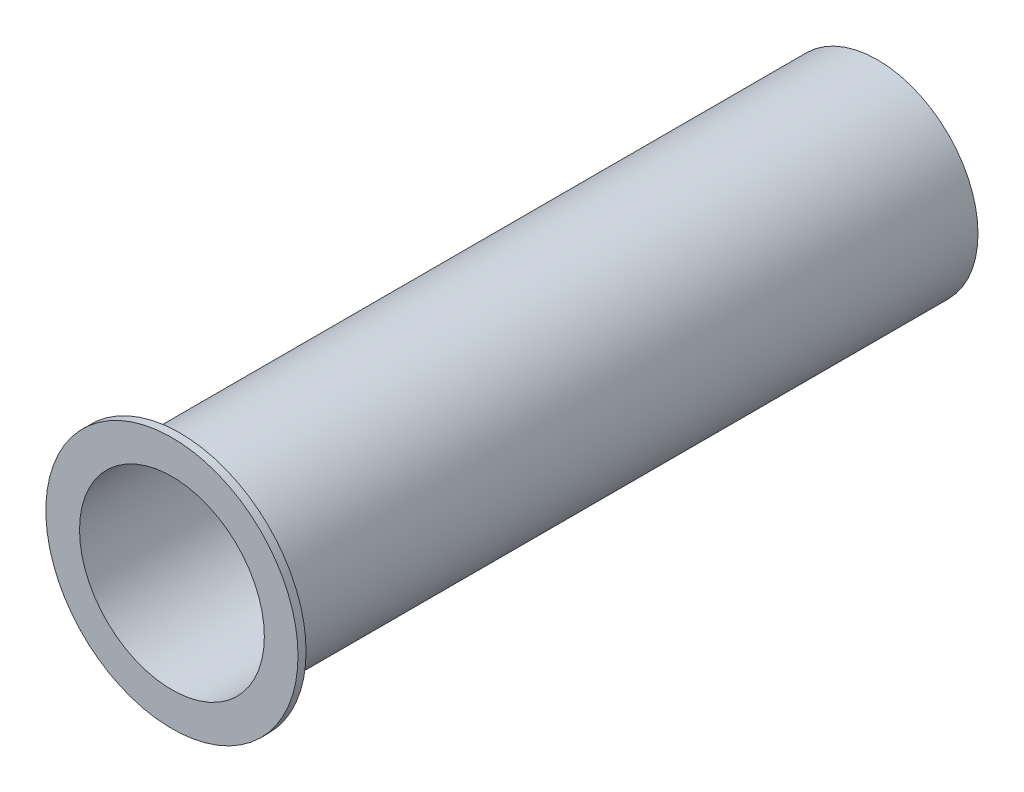
ISO-10303-21;
HEADER;
FILE_DESCRIPTION(('STEP AP214'),'2;1');
FILE_NAME('part.step','',(''),(''),'','','');
FILE_SCHEMA(('AUTOMOTIVE_DESIGN { 1 0 10303 214 1 1 1 1 }'));
ENDSEC;
DATA;
#1=APPLICATION_CONTEXT('core data for automotive mechanical design processes');
#2=APPLICATION_PROTOCOL_DEFINITION('international standard','automotive_design',2000,#1);
#3=PRODUCT_CONTEXT('',#1,'mechanical');
#4=PRODUCT('Part','Part','',(#3));
#5=PRODUCT_RELATED_PRODUCT_CATEGORY('part','',(#4));
#6=PRODUCT_DEFINITION_FORMATION('','',#4);
#7=PRODUCT_DEFINITION_CONTEXT('part definition',#1,'design');
#8=PRODUCT_DEFINITION('design','',#6,#7);
#9=PRODUCT_DEFINITION_SHAPE('','',#8);
#10=(LENGTH_UNIT() NAMED_UNIT(*) SI_UNIT(.MILLI.,.METRE.));
#11=(NAMED_UNIT(*) PLANE_ANGLE_UNIT() SI_UNIT($,.RADIAN.));
#12=(NAMED_UNIT(*) SI_UNIT($,.STERADIAN.) SOLID_ANGLE_UNIT());
#13=UNCERTAINTY_MEASURE_WITH_UNIT(LENGTH_MEASURE(1.E-05),#10,'distance_accuracy_value','');
#14=(GEOMETRIC_REPRESENTATION_CONTEXT(3) GLOBAL_UNCERTAINTY_ASSIGNED_CONTEXT((#13)) GLOBAL_UNIT_ASSIGNED_CONTEXT((#10,
#11,#12)) REPRESENTATION_CONTEXT('',''));
#15=CARTESIAN_POINT('',(0.,0.,0.));
#16=DIRECTION('',(0.,0.,1.));
#17=DIRECTION('',(1.,0.,0.));
#18=AXIS2_PLACEMENT_3D('',#15,#16,#17);
#19=CARTESIAN_POINT('',(0.,0.,0.));
#20=DIRECTION('',(0.,0.,1.));
#21=DIRECTION('',(1.,0.,0.));
#22=AXIS2_PLACEMENT_3D('',#19,#20,#21);
#23=PLANE('',#22);
#24=CARTESIAN_POINT('',(0.,0.,0.));
#25=DIRECTION('',(0.,0.,1.));
#26=DIRECTION('',(1.,0.,0.));
#27=AXIS2_PLACEMENT_3D('',#24,#25,#26);
#28=CIRCLE('',#27,6.25);
#29=CARTESIAN_POINT('',(6.25,0.,0.));
#30=VERTEX_POINT('',#29);
#31=EDGE_CURVE('E37',#30,#30,#28,.T.);
#32=ORIENTED_EDGE('',*,*,#31,.F.);
#33=EDGE_LOOP('',(#32));
#34=FACE_BOUND('',#33,.T.);
#35=CARTESIAN_POINT('',(0.,0.,0.));
#36=DIRECTION('',(0.,0.,1.));
#37=DIRECTION('',(1.,0.,0.));
#38=AXIS2_PLACEMENT_3D('',#35,#36,#37);
#39=CIRCLE('',#38,5.75);
#40=CARTESIAN_POINT('',(5.75,0.,0.));
#41=VERTEX_POINT('',#40);
#42=EDGE_CURVE('E44',#41,#41,#39,.T.);
#43=ORIENTED_EDGE('',*,*,#42,.T.);
#44=EDGE_LOOP('',(#43));
#45=FACE_BOUND('',#44,.T.);
#46=ADVANCED_FACE('F33',(#34,#45),#23,.F.);
#47=CARTESIAN_POINT('',(0.,0.,43.4));
#48=DIRECTION('',(0.,0.,-1.));
#49=DIRECTION('',(-1.,0.,0.));
#50=AXIS2_PLACEMENT_3D('',#47,#48,#49);
#51=CYLINDRICAL_SURFACE('',#50,6.25);
#52=CARTESIAN_POINT('',(0.,0.,43.4));
#53=DIRECTION('',(0.,0.,1.));
#54=DIRECTION('',(1.,0.,0.));
#55=AXIS2_PLACEMENT_3D('',#52,#53,#54);
#56=CIRCLE('',#55,6.25);
#57=CARTESIAN_POINT('',(6.25,0.,43.4));
#58=VERTEX_POINT('',#57);
#59=EDGE_CURVE('E10',#58,#58,#56,.T.);
#60=ORIENTED_EDGE('',*,*,#59,.F.);
#61=EDGE_LOOP('',(#60));
#62=FACE_BOUND('',#61,.T.);
#63=ORIENTED_EDGE('',*,*,#31,.T.);
#64=EDGE_LOOP('',(#63));
#65=FACE_BOUND('',#64,.T.);
#66=ADVANCED_FACE('F35',(#62,#65),#51,.T.);
#67=CARTESIAN_POINT('',(0.,0.,43.4));
#68=DIRECTION('',(0.,0.,-1.));
#69=DIRECTION('',(-1.,0.,0.));
#70=AXIS2_PLACEMENT_3D('',#67,#68,#69);
#71=CYLINDRICAL_SURFACE('',#70,5.75);
#72=ORIENTED_EDGE('',*,*,#42,.F.);
#73=EDGE_LOOP('',(#72));
#74=FACE_BOUND('',#73,.T.);
#75=CARTESIAN_POINT('',(0.,0.,43.9));
#76=DIRECTION('',(0.,0.,1.));
#77=DIRECTION('',(1.,0.,0.));
#78=AXIS2_PLACEMENT_3D('',#75,#76,#77);
#79=CIRCLE('',#78,5.75);
#80=CARTESIAN_POINT('',(5.75,0.,43.9));
#81=VERTEX_POINT('',#80);
#82=EDGE_CURVE('E52',#81,#81,#79,.T.);
#83=ORIENTED_EDGE('',*,*,#82,.T.);
#84=EDGE_LOOP('',(#83));
#85=FACE_BOUND('',#84,.T.);
#86=ADVANCED_FACE('F58',(#74,#85),#71,.F.);
#87=CARTESIAN_POINT('',(0.,0.,43.4));
#88=DIRECTION('',(0.,0.,1.));
#89=DIRECTION('',(1.,0.,0.));
#90=AXIS2_PLACEMENT_3D('',#87,#88,#89);
#91=PLANE('',#90);
#92=CARTESIAN_POINT('',(0.,0.,43.4));
#93=DIRECTION('',(0.,0.,1.));
#94=DIRECTION('',(1.,0.,0.));
#95=AXIS2_PLACEMENT_3D('',#92,#93,#94);
#96=CIRCLE('',#95,7.845);
#97=CARTESIAN_POINT('',(7.845,0.,43.4));
#98=VERTEX_POINT('',#97);
#99=EDGE_CURVE('E49',#98,#98,#96,.T.);
#100=ORIENTED_EDGE('',*,*,#99,.F.);
#101=EDGE_LOOP('',(#100));
#102=FACE_BOUND('',#101,.T.);
#103=ORIENTED_EDGE('',*,*,#59,.T.);
#104=EDGE_LOOP('',(#103));
#105=FACE_BOUND('',#104,.T.);
#106=ADVANCED_FACE('F63',(#102,#105),#91,.F.);
#107=CARTESIAN_POINT('',(0.,0.,43.9));
#108=DIRECTION('',(0.,0.,1.));
#109=DIRECTION('',(1.,0.,0.));
#110=AXIS2_PLACEMENT_3D('',#107,#108,#109);
#111=PLANE('',#110);
#112=CARTESIAN_POINT('',(0.,0.,43.9));
#113=DIRECTION('',(0.,0.,1.));
#114=DIRECTION('',(1.,0.,0.));
#115=AXIS2_PLACEMENT_3D('',#112,#113,#114);
#116=CIRCLE('',#115,7.845);
#117=CARTESIAN_POINT('',(7.845,0.,43.9));
#118=VERTEX_POINT('',#117);
#119=EDGE_CURVE('E48',#118,#118,#116,.T.);
#120=ORIENTED_EDGE('',*,*,#119,.T.);
#121=EDGE_LOOP('',(#120));
#122=FACE_BOUND('',#121,.T.);
#123=ORIENTED_EDGE('',*,*,#82,.F.);
#124=EDGE_LOOP('',(#123));
#125=FACE_BOUND('',#124,.T.);
#126=ADVANCED_FACE('F60',(#122,#125),#111,.T.);
#127=CARTESIAN_POINT('',(0.,0.,43.9));
#128=DIRECTION('',(0.,0.,-1.));
#129=DIRECTION('',(-1.,0.,0.));
#130=AXIS2_PLACEMENT_3D('',#127,#128,#129);
#131=CYLINDRICAL_SURFACE('',#130,7.845);
#132=ORIENTED_EDGE('',*,*,#119,.F.);
#133=EDGE_LOOP('',(#132));
#134=FACE_BOUND('',#133,.T.);
#135=ORIENTED_EDGE('',*,*,#99,.T.);
#136=EDGE_LOOP('',(#135));
#137=FACE_BOUND('',#136,.T.);
#138=ADVANCED_FACE('F62',(#134,#137),#131,.T.);
#139=CLOSED_SHELL('',(#46,#66,#86,#106,#126,#138));
#140=MANIFOLD_SOLID_BREP('B2',#139);
#141=ADVANCED_BREP_SHAPE_REPRESENTATION('',(#18,#140),#14);
#142=SHAPE_DEFINITION_REPRESENTATION(#9,#141);
ENDSEC;
END-ISO-10303-21;
